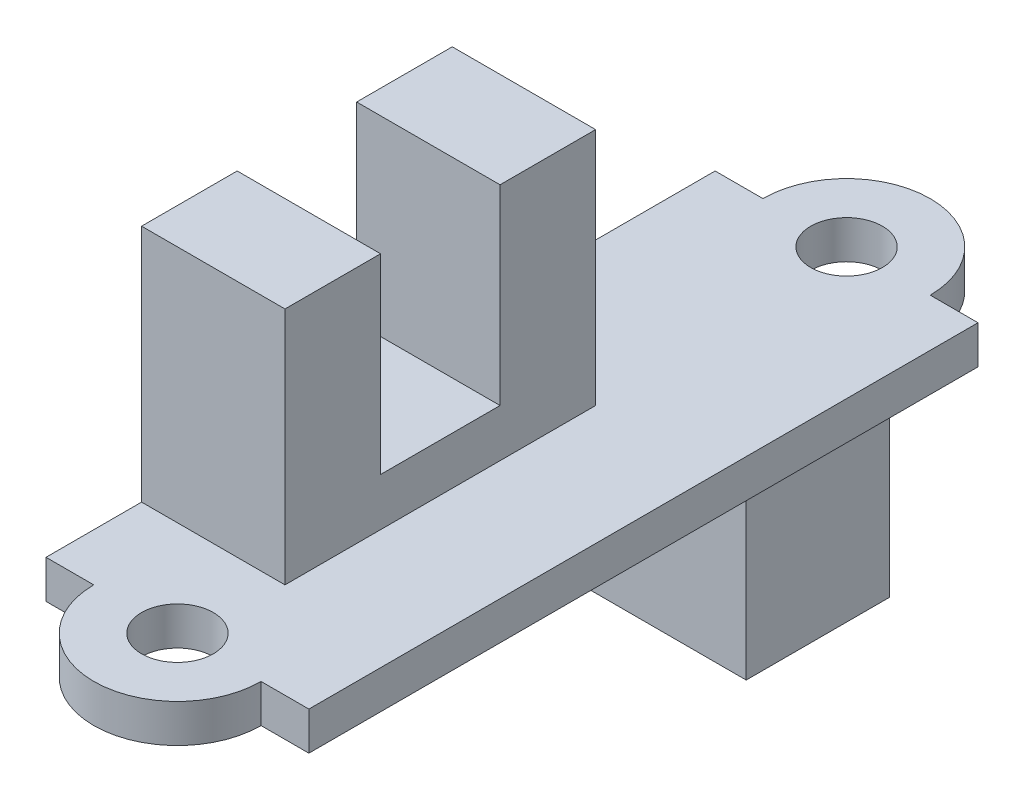
ISO-10303-21;
HEADER;
FILE_DESCRIPTION(('STEP AP214'),'2;1');
FILE_NAME('part.step','',(''),(''),'','','');
FILE_SCHEMA(('AUTOMOTIVE_DESIGN { 1 0 10303 214 1 1 1 1 }'));
ENDSEC;
DATA;
#1=APPLICATION_CONTEXT('core data for automotive mechanical design processes');
#2=APPLICATION_PROTOCOL_DEFINITION('international standard','automotive_design',2000,#1);
#3=PRODUCT_CONTEXT('',#1,'mechanical');
#4=PRODUCT('Part','Part','',(#3));
#5=PRODUCT_RELATED_PRODUCT_CATEGORY('part','',(#4));
#6=PRODUCT_DEFINITION_FORMATION('','',#4);
#7=PRODUCT_DEFINITION_CONTEXT('part definition',#1,'design');
#8=PRODUCT_DEFINITION('design','',#6,#7);
#9=PRODUCT_DEFINITION_SHAPE('','',#8);
#10=(LENGTH_UNIT() NAMED_UNIT(*) SI_UNIT(.MILLI.,.METRE.));
#11=(NAMED_UNIT(*) PLANE_ANGLE_UNIT() SI_UNIT($,.RADIAN.));
#12=(NAMED_UNIT(*) SI_UNIT($,.STERADIAN.) SOLID_ANGLE_UNIT());
#13=UNCERTAINTY_MEASURE_WITH_UNIT(LENGTH_MEASURE(1.E-05),#10,'distance_accuracy_value','');
#14=(GEOMETRIC_REPRESENTATION_CONTEXT(3) GLOBAL_UNCERTAINTY_ASSIGNED_CONTEXT((#13)) GLOBAL_UNIT_ASSIGNED_CONTEXT((#10,
#11,#12)) REPRESENTATION_CONTEXT('',''));
#15=CARTESIAN_POINT('',(0.,0.,0.));
#16=DIRECTION('',(0.,0.,1.));
#17=DIRECTION('',(1.,0.,0.));
#18=AXIS2_PLACEMENT_3D('',#15,#16,#17);
#19=CARTESIAN_POINT('',(0.,0.,0.));
#20=DIRECTION('',(0.,1.,0.));
#21=DIRECTION('',(0.,0.,1.));
#22=AXIS2_PLACEMENT_3D('',#19,#20,#21);
#23=PLANE('',#22);
#24=CARTESIAN_POINT('',(0.,0.,-28.));
#25=DIRECTION('',(0.,1.,0.));
#26=DIRECTION('',(0.,0.,1.));
#27=AXIS2_PLACEMENT_3D('',#24,#25,#26);
#28=CIRCLE('',#27,1.5);
#29=CARTESIAN_POINT('',(0.,0.,-26.5));
#30=VERTEX_POINT('',#29);
#31=EDGE_CURVE('E251',#30,#30,#28,.T.);
#32=ORIENTED_EDGE('',*,*,#31,.T.);
#33=EDGE_LOOP('',(#32));
#34=FACE_BOUND('',#33,.T.);
#35=CARTESIAN_POINT('',(0.,0.,0.));
#36=DIRECTION('',(0.,1.,0.));
#37=DIRECTION('',(0.,0.,1.));
#38=AXIS2_PLACEMENT_3D('',#35,#36,#37);
#39=CIRCLE('',#38,1.5);
#40=CARTESIAN_POINT('',(0.,0.,1.5));
#41=VERTEX_POINT('',#40);
#42=EDGE_CURVE('E255',#41,#41,#39,.T.);
#43=ORIENTED_EDGE('',*,*,#42,.T.);
#44=EDGE_LOOP('',(#43));
#45=FACE_BOUND('',#44,.T.);
#46=CARTESIAN_POINT('',(0.,0.,0.));
#47=DIRECTION('',(0.,1.,0.));
#48=DIRECTION('',(0.,0.,1.));
#49=AXIS2_PLACEMENT_3D('',#46,#47,#48);
#50=CIRCLE('',#49,3.5);
#51=CARTESIAN_POINT('',(-3.5,0.,0.));
#52=VERTEX_POINT('',#51);
#53=CARTESIAN_POINT('',(3.5,0.,0.));
#54=VERTEX_POINT('',#53);
#55=EDGE_CURVE('E261',#52,#54,#50,.T.);
#56=ORIENTED_EDGE('',*,*,#55,.F.);
#57=DIRECTION('',(1.,0.,0.));
#58=VECTOR('',#57,1.);
#59=CARTESIAN_POINT('',(-5.5,0.,0.));
#60=LINE('',#59,#58);
#61=CARTESIAN_POINT('',(-5.5,0.,0.));
#62=VERTEX_POINT('',#61);
#63=EDGE_CURVE('E268',#62,#52,#60,.T.);
#64=ORIENTED_EDGE('',*,*,#63,.F.);
#65=DIRECTION('',(0.,0.,1.));
#66=VECTOR('',#65,1.);
#67=CARTESIAN_POINT('',(-5.5,0.,-28.));
#68=LINE('',#67,#66);
#69=CARTESIAN_POINT('',(-5.5,0.,-28.));
#70=VERTEX_POINT('',#69);
#71=EDGE_CURVE('E297',#70,#62,#68,.T.);
#72=ORIENTED_EDGE('',*,*,#71,.F.);
#73=DIRECTION('',(-1.,0.,0.));
#74=VECTOR('',#73,1.);
#75=CARTESIAN_POINT('',(-5.5,0.,-28.));
#76=LINE('',#75,#74);
#77=CARTESIAN_POINT('',(-3.5,0.,-28.));
#78=VERTEX_POINT('',#77);
#79=EDGE_CURVE('E295',#78,#70,#76,.T.);
#80=ORIENTED_EDGE('',*,*,#79,.F.);
#81=CARTESIAN_POINT('',(0.,0.,-28.));
#82=DIRECTION('',(0.,1.,0.));
#83=DIRECTION('',(0.,0.,1.));
#84=AXIS2_PLACEMENT_3D('',#81,#82,#83);
#85=CIRCLE('',#84,3.5);
#86=CARTESIAN_POINT('',(3.5,0.,-28.));
#87=VERTEX_POINT('',#86);
#88=EDGE_CURVE('E293',#87,#78,#85,.T.);
#89=ORIENTED_EDGE('',*,*,#88,.F.);
#90=DIRECTION('',(-1.,0.,0.));
#91=VECTOR('',#90,1.);
#92=CARTESIAN_POINT('',(3.5,0.,-28.));
#93=LINE('',#92,#91);
#94=CARTESIAN_POINT('',(5.5,0.,-28.));
#95=VERTEX_POINT('',#94);
#96=EDGE_CURVE('E291',#95,#87,#93,.T.);
#97=ORIENTED_EDGE('',*,*,#96,.F.);
#98=DIRECTION('',(0.,0.,-1.));
#99=VECTOR('',#98,1.);
#100=CARTESIAN_POINT('',(5.5,0.,-28.));
#101=LINE('',#100,#99);
#102=CARTESIAN_POINT('',(5.5,0.,0.));
#103=VERTEX_POINT('',#102);
#104=EDGE_CURVE('E289',#103,#95,#101,.T.);
#105=ORIENTED_EDGE('',*,*,#104,.F.);
#106=DIRECTION('',(1.,0.,0.));
#107=VECTOR('',#106,1.);
#108=CARTESIAN_POINT('',(3.5,0.,0.));
#109=LINE('',#108,#107);
#110=EDGE_CURVE('E287',#54,#103,#109,.T.);
#111=ORIENTED_EDGE('',*,*,#110,.F.);
#112=EDGE_LOOP('',(#56,#64,#72,#80,#89,#97,#105,#111));
#113=FACE_BOUND('',#112,.T.);
#114=DIRECTION('',(0.,0.,-1.));
#115=VECTOR('',#114,1.);
#116=CARTESIAN_POINT('',(-5.,0.,-18.8));
#117=LINE('',#116,#115);
#118=CARTESIAN_POINT('',(-5.,0.,-18.8));
#119=VERTEX_POINT('',#118);
#120=CARTESIAN_POINT('',(-5.,0.,-24.8));
#121=VERTEX_POINT('',#120);
#122=EDGE_CURVE('E190',#119,#121,#117,.T.);
#123=ORIENTED_EDGE('',*,*,#122,.F.);
#124=DIRECTION('',(-1.,0.,0.));
#125=VECTOR('',#124,1.);
#126=CARTESIAN_POINT('',(-5.,0.,-18.8));
#127=LINE('',#126,#125);
#128=CARTESIAN_POINT('',(5.,0.,-18.8));
#129=VERTEX_POINT('',#128);
#130=EDGE_CURVE('E187',#129,#119,#127,.T.);
#131=ORIENTED_EDGE('',*,*,#130,.F.);
#132=DIRECTION('',(0.,0.,1.));
#133=VECTOR('',#132,1.);
#134=CARTESIAN_POINT('',(5.,0.,-18.8));
#135=LINE('',#134,#133);
#136=CARTESIAN_POINT('',(5.,0.,-24.8));
#137=VERTEX_POINT('',#136);
#138=EDGE_CURVE('E53',#137,#129,#135,.T.);
#139=ORIENTED_EDGE('',*,*,#138,.F.);
#140=DIRECTION('',(1.,0.,0.));
#141=VECTOR('',#140,1.);
#142=CARTESIAN_POINT('',(-5.,0.,-24.8));
#143=LINE('',#142,#141);
#144=EDGE_CURVE('E48',#121,#137,#143,.T.);
#145=ORIENTED_EDGE('',*,*,#144,.F.);
#146=EDGE_LOOP('',(#123,#131,#139,#145));
#147=FACE_BOUND('',#146,.T.);
#148=ADVANCED_FACE('F33',(#34,#45,#113,#147),#23,.F.);
#149=CARTESIAN_POINT('',(0.,1.6,0.));
#150=DIRECTION('',(0.,1.,0.));
#151=DIRECTION('',(0.,0.,1.));
#152=AXIS2_PLACEMENT_3D('',#149,#150,#151);
#153=PLANE('',#152);
#154=DIRECTION('',(-1.,0.,0.));
#155=VECTOR('',#154,1.);
#156=CARTESIAN_POINT('',(0.500000000000001,1.6,-17.));
#157=LINE('',#156,#155);
#158=CARTESIAN_POINT('',(0.500000000000001,1.6,-17.));
#159=VERTEX_POINT('',#158);
#160=CARTESIAN_POINT('',(-5.5,1.6,-17.));
#161=VERTEX_POINT('',#160);
#162=EDGE_CURVE('E248',#159,#161,#157,.T.);
#163=ORIENTED_EDGE('',*,*,#162,.F.);
#164=DIRECTION('',(0.,0.,-1.));
#165=VECTOR('',#164,1.);
#166=CARTESIAN_POINT('',(0.500000000000001,1.6,-17.));
#167=LINE('',#166,#165);
#168=CARTESIAN_POINT('',(0.500000000000003,1.6,-4.));
#169=VERTEX_POINT('',#168);
#170=EDGE_CURVE('E199',#169,#159,#167,.T.);
#171=ORIENTED_EDGE('',*,*,#170,.F.);
#172=DIRECTION('',(-1.,0.,0.));
#173=VECTOR('',#172,1.);
#174=CARTESIAN_POINT('',(0.500000000000003,1.6,-4.));
#175=LINE('',#174,#173);
#176=CARTESIAN_POINT('',(-5.5,1.6,-4.));
#177=VERTEX_POINT('',#176);
#178=EDGE_CURVE('E216',#169,#177,#175,.T.);
#179=ORIENTED_EDGE('',*,*,#178,.T.);
#180=DIRECTION('',(0.,0.,1.));
#181=VECTOR('',#180,1.);
#182=CARTESIAN_POINT('',(-5.5,1.6,-28.));
#183=LINE('',#182,#181);
#184=CARTESIAN_POINT('',(-5.5,1.6,0.));
#185=VERTEX_POINT('',#184);
#186=EDGE_CURVE('E278',#177,#185,#183,.T.);
#187=ORIENTED_EDGE('',*,*,#186,.T.);
#188=DIRECTION('',(1.,0.,0.));
#189=VECTOR('',#188,1.);
#190=CARTESIAN_POINT('',(-5.5,1.6,0.));
#191=LINE('',#190,#189);
#192=CARTESIAN_POINT('',(-3.5,1.6,0.));
#193=VERTEX_POINT('',#192);
#194=EDGE_CURVE('E282',#185,#193,#191,.T.);
#195=ORIENTED_EDGE('',*,*,#194,.T.);
#196=CARTESIAN_POINT('',(0.,1.6,0.));
#197=DIRECTION('',(0.,1.,0.));
#198=DIRECTION('',(0.,0.,1.));
#199=AXIS2_PLACEMENT_3D('',#196,#197,#198);
#200=CIRCLE('',#199,3.5);
#201=CARTESIAN_POINT('',(3.5,1.6,0.));
#202=VERTEX_POINT('',#201);
#203=EDGE_CURVE('E264',#193,#202,#200,.T.);
#204=ORIENTED_EDGE('',*,*,#203,.T.);
#205=DIRECTION('',(1.,0.,0.));
#206=VECTOR('',#205,1.);
#207=CARTESIAN_POINT('',(3.5,1.6,0.));
#208=LINE('',#207,#206);
#209=CARTESIAN_POINT('',(5.5,1.6,0.));
#210=VERTEX_POINT('',#209);
#211=EDGE_CURVE('E267',#202,#210,#208,.T.);
#212=ORIENTED_EDGE('',*,*,#211,.T.);
#213=DIRECTION('',(0.,0.,-1.));
#214=VECTOR('',#213,1.);
#215=CARTESIAN_POINT('',(5.5,1.6,-28.));
#216=LINE('',#215,#214);
#217=CARTESIAN_POINT('',(5.5,1.6,-28.));
#218=VERTEX_POINT('',#217);
#219=EDGE_CURVE('E270',#210,#218,#216,.T.);
#220=ORIENTED_EDGE('',*,*,#219,.T.);
#221=DIRECTION('',(-1.,0.,0.));
#222=VECTOR('',#221,1.);
#223=CARTESIAN_POINT('',(3.5,1.6,-28.));
#224=LINE('',#223,#222);
#225=CARTESIAN_POINT('',(3.5,1.6,-28.));
#226=VERTEX_POINT('',#225);
#227=EDGE_CURVE('E272',#218,#226,#224,.T.);
#228=ORIENTED_EDGE('',*,*,#227,.T.);
#229=CARTESIAN_POINT('',(0.,1.6,-28.));
#230=DIRECTION('',(0.,1.,0.));
#231=DIRECTION('',(0.,0.,1.));
#232=AXIS2_PLACEMENT_3D('',#229,#230,#231);
#233=CIRCLE('',#232,3.5);
#234=CARTESIAN_POINT('',(-3.5,1.6,-28.));
#235=VERTEX_POINT('',#234);
#236=EDGE_CURVE('E274',#226,#235,#233,.T.);
#237=ORIENTED_EDGE('',*,*,#236,.T.);
#238=DIRECTION('',(-1.,0.,0.));
#239=VECTOR('',#238,1.);
#240=CARTESIAN_POINT('',(-5.5,1.6,-28.));
#241=LINE('',#240,#239);
#242=CARTESIAN_POINT('',(-5.5,1.6,-28.));
#243=VERTEX_POINT('',#242);
#244=EDGE_CURVE('E276',#235,#243,#241,.T.);
#245=ORIENTED_EDGE('',*,*,#244,.T.);
#246=EDGE_CURVE('E279',#243,#161,#183,.T.);
#247=ORIENTED_EDGE('',*,*,#246,.T.);
#248=EDGE_LOOP('',(#163,#171,#179,#187,#195,#204,#212,#220,#228,#237,#245,#247));
#249=FACE_BOUND('',#248,.T.);
#250=CARTESIAN_POINT('',(0.,1.6,0.));
#251=DIRECTION('',(0.,1.,0.));
#252=DIRECTION('',(0.,0.,1.));
#253=AXIS2_PLACEMENT_3D('',#250,#251,#252);
#254=CIRCLE('',#253,1.5);
#255=CARTESIAN_POINT('',(0.,1.6,1.5));
#256=VERTEX_POINT('',#255);
#257=EDGE_CURVE('E258',#256,#256,#254,.T.);
#258=ORIENTED_EDGE('',*,*,#257,.F.);
#259=EDGE_LOOP('',(#258));
#260=FACE_BOUND('',#259,.T.);
#261=CARTESIAN_POINT('',(0.,1.6,-28.));
#262=DIRECTION('',(0.,1.,0.));
#263=DIRECTION('',(0.,0.,1.));
#264=AXIS2_PLACEMENT_3D('',#261,#262,#263);
#265=CIRCLE('',#264,1.5);
#266=CARTESIAN_POINT('',(0.,1.6,-26.5));
#267=VERTEX_POINT('',#266);
#268=EDGE_CURVE('E252',#267,#267,#265,.T.);
#269=ORIENTED_EDGE('',*,*,#268,.F.);
#270=EDGE_LOOP('',(#269));
#271=FACE_BOUND('',#270,.T.);
#272=ADVANCED_FACE('F340',(#249,#260,#271),#153,.T.);
#273=CARTESIAN_POINT('',(0.,1.6,0.));
#274=DIRECTION('',(0.,-1.,0.));
#275=DIRECTION('',(0.,0.,-1.));
#276=AXIS2_PLACEMENT_3D('',#273,#274,#275);
#277=CYLINDRICAL_SURFACE('',#276,3.5);
#278=ORIENTED_EDGE('',*,*,#55,.T.);
#279=DIRECTION('',(0.,-1.,0.));
#280=VECTOR('',#279,1.);
#281=CARTESIAN_POINT('',(3.5,1.6,0.));
#282=LINE('',#281,#280);
#283=EDGE_CURVE('E11',#202,#54,#282,.T.);
#284=ORIENTED_EDGE('',*,*,#283,.F.);
#285=ORIENTED_EDGE('',*,*,#203,.F.);
#286=DIRECTION('',(0.,-1.,0.));
#287=VECTOR('',#286,1.);
#288=CARTESIAN_POINT('',(-3.5,1.6,0.));
#289=LINE('',#288,#287);
#290=EDGE_CURVE('E284',#193,#52,#289,.T.);
#291=ORIENTED_EDGE('',*,*,#290,.T.);
#292=EDGE_LOOP('',(#278,#284,#285,#291));
#293=FACE_BOUND('',#292,.T.);
#294=ADVANCED_FACE('F35',(#293),#277,.T.);
#295=CARTESIAN_POINT('',(3.5,1.6,0.));
#296=DIRECTION('',(0.,0.,-1.));
#297=DIRECTION('',(-1.,0.,0.));
#298=AXIS2_PLACEMENT_3D('',#295,#296,#297);
#299=PLANE('',#298);
#300=ORIENTED_EDGE('',*,*,#110,.T.);
#301=DIRECTION('',(0.,-1.,0.));
#302=VECTOR('',#301,1.);
#303=CARTESIAN_POINT('',(5.5,1.6,0.));
#304=LINE('',#303,#302);
#305=EDGE_CURVE('E41',#210,#103,#304,.T.);
#306=ORIENTED_EDGE('',*,*,#305,.F.);
#307=ORIENTED_EDGE('',*,*,#211,.F.);
#308=ORIENTED_EDGE('',*,*,#283,.T.);
#309=EDGE_LOOP('',(#300,#306,#307,#308));
#310=FACE_BOUND('',#309,.T.);
#311=ADVANCED_FACE('F345',(#310),#299,.F.);
#312=CARTESIAN_POINT('',(5.5,1.6,-28.));
#313=DIRECTION('',(-1.,0.,0.));
#314=DIRECTION('',(0.,0.,1.));
#315=AXIS2_PLACEMENT_3D('',#312,#313,#314);
#316=PLANE('',#315);
#317=ORIENTED_EDGE('',*,*,#104,.T.);
#318=DIRECTION('',(0.,-1.,0.));
#319=VECTOR('',#318,1.);
#320=CARTESIAN_POINT('',(5.5,1.6,-28.));
#321=LINE('',#320,#319);
#322=EDGE_CURVE('E314',#218,#95,#321,.T.);
#323=ORIENTED_EDGE('',*,*,#322,.F.);
#324=ORIENTED_EDGE('',*,*,#219,.F.);
#325=ORIENTED_EDGE('',*,*,#305,.T.);
#326=EDGE_LOOP('',(#317,#323,#324,#325));
#327=FACE_BOUND('',#326,.T.);
#328=ADVANCED_FACE('F321',(#327),#316,.F.);
#329=CARTESIAN_POINT('',(3.5,1.6,-28.));
#330=DIRECTION('',(0.,0.,1.));
#331=DIRECTION('',(1.,0.,0.));
#332=AXIS2_PLACEMENT_3D('',#329,#330,#331);
#333=PLANE('',#332);
#334=ORIENTED_EDGE('',*,*,#96,.T.);
#335=DIRECTION('',(0.,-1.,0.));
#336=VECTOR('',#335,1.);
#337=CARTESIAN_POINT('',(3.5,1.6,-28.));
#338=LINE('',#337,#336);
#339=EDGE_CURVE('E311',#226,#87,#338,.T.);
#340=ORIENTED_EDGE('',*,*,#339,.F.);
#341=ORIENTED_EDGE('',*,*,#227,.F.);
#342=ORIENTED_EDGE('',*,*,#322,.T.);
#343=EDGE_LOOP('',(#334,#340,#341,#342));
#344=FACE_BOUND('',#343,.T.);
#345=ADVANCED_FACE('F331',(#344),#333,.F.);
#346=CARTESIAN_POINT('',(0.,1.6,-28.));
#347=DIRECTION('',(0.,-1.,0.));
#348=DIRECTION('',(0.,0.,-1.));
#349=AXIS2_PLACEMENT_3D('',#346,#347,#348);
#350=CYLINDRICAL_SURFACE('',#349,3.5);
#351=ORIENTED_EDGE('',*,*,#88,.T.);
#352=DIRECTION('',(0.,-1.,0.));
#353=VECTOR('',#352,1.);
#354=CARTESIAN_POINT('',(-3.5,1.6,-28.));
#355=LINE('',#354,#353);
#356=EDGE_CURVE('E308',#235,#78,#355,.T.);
#357=ORIENTED_EDGE('',*,*,#356,.F.);
#358=ORIENTED_EDGE('',*,*,#236,.F.);
#359=ORIENTED_EDGE('',*,*,#339,.T.);
#360=EDGE_LOOP('',(#351,#357,#358,#359));
#361=FACE_BOUND('',#360,.T.);
#362=ADVANCED_FACE('F335',(#361),#350,.T.);
#363=CARTESIAN_POINT('',(-5.5,1.6,-28.));
#364=DIRECTION('',(0.,0.,1.));
#365=DIRECTION('',(1.,0.,0.));
#366=AXIS2_PLACEMENT_3D('',#363,#364,#365);
#367=PLANE('',#366);
#368=ORIENTED_EDGE('',*,*,#79,.T.);
#369=DIRECTION('',(0.,-1.,0.));
#370=VECTOR('',#369,1.);
#371=CARTESIAN_POINT('',(-5.5,1.6,-28.));
#372=LINE('',#371,#370);
#373=EDGE_CURVE('E305',#243,#70,#372,.T.);
#374=ORIENTED_EDGE('',*,*,#373,.F.);
#375=ORIENTED_EDGE('',*,*,#244,.F.);
#376=ORIENTED_EDGE('',*,*,#356,.T.);
#377=EDGE_LOOP('',(#368,#374,#375,#376));
#378=FACE_BOUND('',#377,.T.);
#379=ADVANCED_FACE('F360',(#378),#367,.F.);
#380=CARTESIAN_POINT('',(-5.5,1.6,-28.));
#381=DIRECTION('',(1.,0.,0.));
#382=DIRECTION('',(0.,0.,-1.));
#383=AXIS2_PLACEMENT_3D('',#380,#381,#382);
#384=PLANE('',#383);
#385=ORIENTED_EDGE('',*,*,#71,.T.);
#386=DIRECTION('',(0.,-1.,0.));
#387=VECTOR('',#386,1.);
#388=CARTESIAN_POINT('',(-5.5,1.6,0.));
#389=LINE('',#388,#387);
#390=EDGE_CURVE('E302',#185,#62,#389,.T.);
#391=ORIENTED_EDGE('',*,*,#390,.F.);
#392=ORIENTED_EDGE('',*,*,#186,.F.);
#393=DIRECTION('',(0.,-1.,0.));
#394=VECTOR('',#393,1.);
#395=CARTESIAN_POINT('',(-5.5,1.6,-4.));
#396=LINE('',#395,#394);
#397=CARTESIAN_POINT('',(-5.5,11.6,-4.));
#398=VERTEX_POINT('',#397);
#399=EDGE_CURVE('E203',#398,#177,#396,.T.);
#400=ORIENTED_EDGE('',*,*,#399,.F.);
#401=DIRECTION('',(0.,0.,1.));
#402=VECTOR('',#401,1.);
#403=CARTESIAN_POINT('',(-5.5,11.6,-4.));
#404=LINE('',#403,#402);
#405=CARTESIAN_POINT('',(-5.5,11.6,-8.));
#406=VERTEX_POINT('',#405);
#407=EDGE_CURVE('E225',#406,#398,#404,.T.);
#408=ORIENTED_EDGE('',*,*,#407,.F.);
#409=DIRECTION('',(0.,1.,0.));
#410=VECTOR('',#409,1.);
#411=CARTESIAN_POINT('',(-5.5,11.6,-8.));
#412=LINE('',#411,#410);
#413=CARTESIAN_POINT('',(-5.5,3.6,-8.));
#414=VERTEX_POINT('',#413);
#415=EDGE_CURVE('E223',#414,#406,#412,.T.);
#416=ORIENTED_EDGE('',*,*,#415,.F.);
#417=DIRECTION('',(0.,0.,1.));
#418=VECTOR('',#417,1.);
#419=CARTESIAN_POINT('',(-5.5,3.6,-8.));
#420=LINE('',#419,#418);
#421=CARTESIAN_POINT('',(-5.5,3.6,-13.));
#422=VERTEX_POINT('',#421);
#423=EDGE_CURVE('E221',#422,#414,#420,.T.);
#424=ORIENTED_EDGE('',*,*,#423,.F.);
#425=DIRECTION('',(0.,-1.,0.));
#426=VECTOR('',#425,1.);
#427=CARTESIAN_POINT('',(-5.5,3.6,-13.));
#428=LINE('',#427,#426);
#429=CARTESIAN_POINT('',(-5.5,11.6,-13.));
#430=VERTEX_POINT('',#429);
#431=EDGE_CURVE('E219',#430,#422,#428,.T.);
#432=ORIENTED_EDGE('',*,*,#431,.F.);
#433=DIRECTION('',(0.,0.,1.));
#434=VECTOR('',#433,1.);
#435=CARTESIAN_POINT('',(-5.5,11.6,-13.));
#436=LINE('',#435,#434);
#437=CARTESIAN_POINT('',(-5.5,11.6,-17.));
#438=VERTEX_POINT('',#437);
#439=EDGE_CURVE('E193',#438,#430,#436,.T.);
#440=ORIENTED_EDGE('',*,*,#439,.F.);
#441=DIRECTION('',(0.,1.,0.));
#442=VECTOR('',#441,1.);
#443=CARTESIAN_POINT('',(-5.5,11.6,-17.));
#444=LINE('',#443,#442);
#445=EDGE_CURVE('E191',#161,#438,#444,.T.);
#446=ORIENTED_EDGE('',*,*,#445,.F.);
#447=ORIENTED_EDGE('',*,*,#246,.F.);
#448=ORIENTED_EDGE('',*,*,#373,.T.);
#449=EDGE_LOOP('',(#385,#391,#392,#400,#408,#416,#424,#432,#440,#446,#447,#448));
#450=FACE_BOUND('',#449,.T.);
#451=ADVANCED_FACE('F356',(#450),#384,.F.);
#452=CARTESIAN_POINT('',(-5.5,1.6,0.));
#453=DIRECTION('',(0.,0.,-1.));
#454=DIRECTION('',(-1.,0.,0.));
#455=AXIS2_PLACEMENT_3D('',#452,#453,#454);
#456=PLANE('',#455);
#457=ORIENTED_EDGE('',*,*,#63,.T.);
#458=ORIENTED_EDGE('',*,*,#290,.F.);
#459=ORIENTED_EDGE('',*,*,#194,.F.);
#460=ORIENTED_EDGE('',*,*,#390,.T.);
#461=EDGE_LOOP('',(#457,#458,#459,#460));
#462=FACE_BOUND('',#461,.T.);
#463=ADVANCED_FACE('F351',(#462),#456,.F.);
#464=CARTESIAN_POINT('',(0.,1.6,0.));
#465=DIRECTION('',(0.,-1.,0.));
#466=DIRECTION('',(0.,0.,-1.));
#467=AXIS2_PLACEMENT_3D('',#464,#465,#466);
#468=CYLINDRICAL_SURFACE('',#467,1.5);
#469=ORIENTED_EDGE('',*,*,#257,.T.);
#470=EDGE_LOOP('',(#469));
#471=FACE_BOUND('',#470,.T.);
#472=ORIENTED_EDGE('',*,*,#42,.F.);
#473=EDGE_LOOP('',(#472));
#474=FACE_BOUND('',#473,.T.);
#475=ADVANCED_FACE('F380',(#471,#474),#468,.F.);
#476=CARTESIAN_POINT('',(0.,1.6,-28.));
#477=DIRECTION('',(0.,-1.,0.));
#478=DIRECTION('',(0.,0.,-1.));
#479=AXIS2_PLACEMENT_3D('',#476,#477,#478);
#480=CYLINDRICAL_SURFACE('',#479,1.5);
#481=ORIENTED_EDGE('',*,*,#268,.T.);
#482=EDGE_LOOP('',(#481));
#483=FACE_BOUND('',#482,.T.);
#484=ORIENTED_EDGE('',*,*,#31,.F.);
#485=EDGE_LOOP('',(#484));
#486=FACE_BOUND('',#485,.T.);
#487=ADVANCED_FACE('F384',(#483,#486),#480,.F.);
#488=CARTESIAN_POINT('',(0.500000000000001,11.6,-17.));
#489=DIRECTION('',(0.,0.,1.));
#490=DIRECTION('',(1.,0.,0.));
#491=AXIS2_PLACEMENT_3D('',#488,#489,#490);
#492=PLANE('',#491);
#493=ORIENTED_EDGE('',*,*,#445,.T.);
#494=DIRECTION('',(-1.,0.,0.));
#495=VECTOR('',#494,1.);
#496=CARTESIAN_POINT('',(0.500000000000001,11.6,-17.));
#497=LINE('',#496,#495);
#498=CARTESIAN_POINT('',(0.500000000000001,11.6,-17.));
#499=VERTEX_POINT('',#498);
#500=EDGE_CURVE('E245',#499,#438,#497,.T.);
#501=ORIENTED_EDGE('',*,*,#500,.F.);
#502=DIRECTION('',(0.,1.,0.));
#503=VECTOR('',#502,1.);
#504=CARTESIAN_POINT('',(0.500000000000001,11.6,-17.));
#505=LINE('',#504,#503);
#506=EDGE_CURVE('E202',#159,#499,#505,.T.);
#507=ORIENTED_EDGE('',*,*,#506,.F.);
#508=ORIENTED_EDGE('',*,*,#162,.T.);
#509=EDGE_LOOP('',(#493,#501,#507,#508));
#510=FACE_BOUND('',#509,.T.);
#511=ADVANCED_FACE('F389',(#510),#492,.F.);
#512=CARTESIAN_POINT('',(0.500000000000002,11.6,-13.));
#513=DIRECTION('',(0.,-1.,0.));
#514=DIRECTION('',(0.,0.,-1.));
#515=AXIS2_PLACEMENT_3D('',#512,#513,#514);
#516=PLANE('',#515);
#517=ORIENTED_EDGE('',*,*,#439,.T.);
#518=DIRECTION('',(-1.,0.,0.));
#519=VECTOR('',#518,1.);
#520=CARTESIAN_POINT('',(0.500000000000002,11.6,-13.));
#521=LINE('',#520,#519);
#522=CARTESIAN_POINT('',(0.500000000000002,11.6,-13.));
#523=VERTEX_POINT('',#522);
#524=EDGE_CURVE('E242',#523,#430,#521,.T.);
#525=ORIENTED_EDGE('',*,*,#524,.F.);
#526=DIRECTION('',(0.,0.,1.));
#527=VECTOR('',#526,1.);
#528=CARTESIAN_POINT('',(0.500000000000002,11.6,-13.));
#529=LINE('',#528,#527);
#530=EDGE_CURVE('E205',#499,#523,#529,.T.);
#531=ORIENTED_EDGE('',*,*,#530,.F.);
#532=ORIENTED_EDGE('',*,*,#500,.T.);
#533=EDGE_LOOP('',(#517,#525,#531,#532));
#534=FACE_BOUND('',#533,.T.);
#535=ADVANCED_FACE('F396',(#534),#516,.F.);
#536=CARTESIAN_POINT('',(0.500000000000002,3.6,-13.));
#537=DIRECTION('',(0.,0.,-1.));
#538=DIRECTION('',(-1.,0.,0.));
#539=AXIS2_PLACEMENT_3D('',#536,#537,#538);
#540=PLANE('',#539);
#541=ORIENTED_EDGE('',*,*,#431,.T.);
#542=DIRECTION('',(-1.,0.,0.));
#543=VECTOR('',#542,1.);
#544=CARTESIAN_POINT('',(0.500000000000002,3.6,-13.));
#545=LINE('',#544,#543);
#546=CARTESIAN_POINT('',(0.500000000000002,3.6,-13.));
#547=VERTEX_POINT('',#546);
#548=EDGE_CURVE('E239',#547,#422,#545,.T.);
#549=ORIENTED_EDGE('',*,*,#548,.F.);
#550=DIRECTION('',(0.,-1.,0.));
#551=VECTOR('',#550,1.);
#552=CARTESIAN_POINT('',(0.500000000000002,3.6,-13.));
#553=LINE('',#552,#551);
#554=EDGE_CURVE('E207',#523,#547,#553,.T.);
#555=ORIENTED_EDGE('',*,*,#554,.F.);
#556=ORIENTED_EDGE('',*,*,#524,.T.);
#557=EDGE_LOOP('',(#541,#549,#555,#556));
#558=FACE_BOUND('',#557,.T.);
#559=ADVANCED_FACE('F400',(#558),#540,.F.);
#560=CARTESIAN_POINT('',(0.500000000000003,3.6,-8.));
#561=DIRECTION('',(0.,-1.,0.));
#562=DIRECTION('',(0.,0.,-1.));
#563=AXIS2_PLACEMENT_3D('',#560,#561,#562);
#564=PLANE('',#563);
#565=ORIENTED_EDGE('',*,*,#423,.T.);
#566=DIRECTION('',(-1.,0.,0.));
#567=VECTOR('',#566,1.);
#568=CARTESIAN_POINT('',(0.500000000000003,3.6,-8.));
#569=LINE('',#568,#567);
#570=CARTESIAN_POINT('',(0.500000000000003,3.6,-8.));
#571=VERTEX_POINT('',#570);
#572=EDGE_CURVE('E236',#571,#414,#569,.T.);
#573=ORIENTED_EDGE('',*,*,#572,.F.);
#574=DIRECTION('',(0.,0.,1.));
#575=VECTOR('',#574,1.);
#576=CARTESIAN_POINT('',(0.500000000000003,3.6,-8.));
#577=LINE('',#576,#575);
#578=EDGE_CURVE('E209',#547,#571,#577,.T.);
#579=ORIENTED_EDGE('',*,*,#578,.F.);
#580=ORIENTED_EDGE('',*,*,#548,.T.);
#581=EDGE_LOOP('',(#565,#573,#579,#580));
#582=FACE_BOUND('',#581,.T.);
#583=ADVANCED_FACE('F404',(#582),#564,.F.);
#584=CARTESIAN_POINT('',(0.500000000000003,11.6,-8.));
#585=DIRECTION('',(0.,0.,1.));
#586=DIRECTION('',(1.,0.,0.));
#587=AXIS2_PLACEMENT_3D('',#584,#585,#586);
#588=PLANE('',#587);
#589=ORIENTED_EDGE('',*,*,#415,.T.);
#590=DIRECTION('',(-1.,0.,0.));
#591=VECTOR('',#590,1.);
#592=CARTESIAN_POINT('',(0.500000000000003,11.6,-8.));
#593=LINE('',#592,#591);
#594=CARTESIAN_POINT('',(0.500000000000003,11.6,-8.));
#595=VERTEX_POINT('',#594);
#596=EDGE_CURVE('E233',#595,#406,#593,.T.);
#597=ORIENTED_EDGE('',*,*,#596,.F.);
#598=DIRECTION('',(0.,1.,0.));
#599=VECTOR('',#598,1.);
#600=CARTESIAN_POINT('',(0.500000000000003,11.6,-8.));
#601=LINE('',#600,#599);
#602=EDGE_CURVE('E211',#571,#595,#601,.T.);
#603=ORIENTED_EDGE('',*,*,#602,.F.);
#604=ORIENTED_EDGE('',*,*,#572,.T.);
#605=EDGE_LOOP('',(#589,#597,#603,#604));
#606=FACE_BOUND('',#605,.T.);
#607=ADVANCED_FACE('F408',(#606),#588,.F.);
#608=CARTESIAN_POINT('',(0.500000000000003,11.6,-4.));
#609=DIRECTION('',(0.,-1.,0.));
#610=DIRECTION('',(0.,0.,-1.));
#611=AXIS2_PLACEMENT_3D('',#608,#609,#610);
#612=PLANE('',#611);
#613=ORIENTED_EDGE('',*,*,#407,.T.);
#614=DIRECTION('',(-1.,0.,0.));
#615=VECTOR('',#614,1.);
#616=CARTESIAN_POINT('',(0.500000000000003,11.6,-4.));
#617=LINE('',#616,#615);
#618=CARTESIAN_POINT('',(0.500000000000003,11.6,-4.));
#619=VERTEX_POINT('',#618);
#620=EDGE_CURVE('E230',#619,#398,#617,.T.);
#621=ORIENTED_EDGE('',*,*,#620,.F.);
#622=DIRECTION('',(0.,0.,1.));
#623=VECTOR('',#622,1.);
#624=CARTESIAN_POINT('',(0.500000000000003,11.6,-4.));
#625=LINE('',#624,#623);
#626=EDGE_CURVE('E213',#595,#619,#625,.T.);
#627=ORIENTED_EDGE('',*,*,#626,.F.);
#628=ORIENTED_EDGE('',*,*,#596,.T.);
#629=EDGE_LOOP('',(#613,#621,#627,#628));
#630=FACE_BOUND('',#629,.T.);
#631=ADVANCED_FACE('F412',(#630),#612,.F.);
#632=CARTESIAN_POINT('',(0.500000000000003,1.6,-4.));
#633=DIRECTION('',(0.,0.,-1.));
#634=DIRECTION('',(-1.,0.,0.));
#635=AXIS2_PLACEMENT_3D('',#632,#633,#634);
#636=PLANE('',#635);
#637=ORIENTED_EDGE('',*,*,#399,.T.);
#638=ORIENTED_EDGE('',*,*,#178,.F.);
#639=DIRECTION('',(0.,-1.,0.));
#640=VECTOR('',#639,1.);
#641=CARTESIAN_POINT('',(0.500000000000003,1.6,-4.));
#642=LINE('',#641,#640);
#643=EDGE_CURVE('E215',#619,#169,#642,.T.);
#644=ORIENTED_EDGE('',*,*,#643,.F.);
#645=ORIENTED_EDGE('',*,*,#620,.T.);
#646=EDGE_LOOP('',(#637,#638,#644,#645));
#647=FACE_BOUND('',#646,.T.);
#648=ADVANCED_FACE('F416',(#647),#636,.F.);
#649=CARTESIAN_POINT('',(0.500000000000004,0.,0.));
#650=DIRECTION('',(-1.,0.,0.));
#651=DIRECTION('',(0.,0.,1.));
#652=AXIS2_PLACEMENT_3D('',#649,#650,#651);
#653=PLANE('',#652);
#654=ORIENTED_EDGE('',*,*,#170,.T.);
#655=ORIENTED_EDGE('',*,*,#506,.T.);
#656=ORIENTED_EDGE('',*,*,#530,.T.);
#657=ORIENTED_EDGE('',*,*,#554,.T.);
#658=ORIENTED_EDGE('',*,*,#578,.T.);
#659=ORIENTED_EDGE('',*,*,#602,.T.);
#660=ORIENTED_EDGE('',*,*,#626,.T.);
#661=ORIENTED_EDGE('',*,*,#643,.T.);
#662=EDGE_LOOP('',(#654,#655,#656,#657,#658,#659,#660,#661));
#663=FACE_BOUND('',#662,.T.);
#664=ADVANCED_FACE('F420',(#663),#653,.F.);
#665=CARTESIAN_POINT('',(-5.,-7.,-18.8));
#666=DIRECTION('',(1.,0.,0.));
#667=DIRECTION('',(0.,0.,-1.));
#668=AXIS2_PLACEMENT_3D('',#665,#666,#667);
#669=PLANE('',#668);
#670=ORIENTED_EDGE('',*,*,#122,.T.);
#671=DIRECTION('',(0.,1.,0.));
#672=VECTOR('',#671,1.);
#673=CARTESIAN_POINT('',(-5.,-7.,-24.8));
#674=LINE('',#673,#672);
#675=CARTESIAN_POINT('',(-5.,-7.,-24.8));
#676=VERTEX_POINT('',#675);
#677=EDGE_CURVE('E171',#676,#121,#674,.T.);
#678=ORIENTED_EDGE('',*,*,#677,.F.);
#679=DIRECTION('',(0.,0.,-1.));
#680=VECTOR('',#679,1.);
#681=CARTESIAN_POINT('',(-5.,-7.,-18.8));
#682=LINE('',#681,#680);
#683=CARTESIAN_POINT('',(-5.,-7.,-18.8));
#684=VERTEX_POINT('',#683);
#685=EDGE_CURVE('E178',#684,#676,#682,.T.);
#686=ORIENTED_EDGE('',*,*,#685,.F.);
#687=DIRECTION('',(0.,1.,0.));
#688=VECTOR('',#687,1.);
#689=CARTESIAN_POINT('',(-5.,-7.,-18.8));
#690=LINE('',#689,#688);
#691=EDGE_CURVE('E591',#684,#119,#690,.T.);
#692=ORIENTED_EDGE('',*,*,#691,.T.);
#693=EDGE_LOOP('',(#670,#678,#686,#692));
#694=FACE_BOUND('',#693,.T.);
#695=ADVANCED_FACE('F189',(#694),#669,.F.);
#696=CARTESIAN_POINT('',(-5.,-7.,-24.8));
#697=DIRECTION('',(0.,0.,1.));
#698=DIRECTION('',(1.,0.,0.));
#699=AXIS2_PLACEMENT_3D('',#696,#697,#698);
#700=PLANE('',#699);
#701=ORIENTED_EDGE('',*,*,#144,.T.);
#702=DIRECTION('',(0.,1.,0.));
#703=VECTOR('',#702,1.);
#704=CARTESIAN_POINT('',(5.,-7.,-24.8));
#705=LINE('',#704,#703);
#706=CARTESIAN_POINT('',(5.,-7.,-24.8));
#707=VERTEX_POINT('',#706);
#708=EDGE_CURVE('E174',#707,#137,#705,.T.);
#709=ORIENTED_EDGE('',*,*,#708,.F.);
#710=DIRECTION('',(1.,0.,0.));
#711=VECTOR('',#710,1.);
#712=CARTESIAN_POINT('',(-5.,-7.,-24.8));
#713=LINE('',#712,#711);
#714=EDGE_CURVE('E167',#676,#707,#713,.T.);
#715=ORIENTED_EDGE('',*,*,#714,.F.);
#716=ORIENTED_EDGE('',*,*,#677,.T.);
#717=EDGE_LOOP('',(#701,#709,#715,#716));
#718=FACE_BOUND('',#717,.T.);
#719=ADVANCED_FACE('F169',(#718),#700,.F.);
#720=CARTESIAN_POINT('',(5.,-7.,-18.8));
#721=DIRECTION('',(-1.,0.,0.));
#722=DIRECTION('',(0.,0.,1.));
#723=AXIS2_PLACEMENT_3D('',#720,#721,#722);
#724=PLANE('',#723);
#725=ORIENTED_EDGE('',*,*,#138,.T.);
#726=DIRECTION('',(0.,1.,0.));
#727=VECTOR('',#726,1.);
#728=CARTESIAN_POINT('',(5.,-7.,-18.8));
#729=LINE('',#728,#727);
#730=CARTESIAN_POINT('',(5.,-7.,-18.8));
#731=VERTEX_POINT('',#730);
#732=EDGE_CURVE('E195',#731,#129,#729,.T.);
#733=ORIENTED_EDGE('',*,*,#732,.F.);
#734=DIRECTION('',(0.,0.,1.));
#735=VECTOR('',#734,1.);
#736=CARTESIAN_POINT('',(5.,-7.,-18.8));
#737=LINE('',#736,#735);
#738=EDGE_CURVE('E177',#707,#731,#737,.T.);
#739=ORIENTED_EDGE('',*,*,#738,.F.);
#740=ORIENTED_EDGE('',*,*,#708,.T.);
#741=EDGE_LOOP('',(#725,#733,#739,#740));
#742=FACE_BOUND('',#741,.T.);
#743=ADVANCED_FACE('F429',(#742),#724,.F.);
#744=CARTESIAN_POINT('',(-5.,-7.,-18.8));
#745=DIRECTION('',(0.,0.,-1.));
#746=DIRECTION('',(-1.,0.,0.));
#747=AXIS2_PLACEMENT_3D('',#744,#745,#746);
#748=PLANE('',#747);
#749=ORIENTED_EDGE('',*,*,#130,.T.);
#750=ORIENTED_EDGE('',*,*,#691,.F.);
#751=DIRECTION('',(-1.,0.,0.));
#752=VECTOR('',#751,1.);
#753=CARTESIAN_POINT('',(-5.,-7.,-18.8));
#754=LINE('',#753,#752);
#755=EDGE_CURVE('E183',#731,#684,#754,.T.);
#756=ORIENTED_EDGE('',*,*,#755,.F.);
#757=ORIENTED_EDGE('',*,*,#732,.T.);
#758=EDGE_LOOP('',(#749,#750,#756,#757));
#759=FACE_BOUND('',#758,.T.);
#760=ADVANCED_FACE('F432',(#759),#748,.F.);
#761=CARTESIAN_POINT('',(0.,-7.,0.));
#762=DIRECTION('',(0.,-1.,0.));
#763=DIRECTION('',(0.,0.,-1.));
#764=AXIS2_PLACEMENT_3D('',#761,#762,#763);
#765=PLANE('',#764);
#766=ORIENTED_EDGE('',*,*,#685,.T.);
#767=ORIENTED_EDGE('',*,*,#714,.T.);
#768=ORIENTED_EDGE('',*,*,#738,.T.);
#769=ORIENTED_EDGE('',*,*,#755,.T.);
#770=EDGE_LOOP('',(#766,#767,#768,#769));
#771=FACE_BOUND('',#770,.T.);
#772=ADVANCED_FACE('F181',(#771),#765,.T.);
#773=CLOSED_SHELL('',(#148,#272,#294,#311,#328,#345,#362,#379,#451,#463,#475,#487,#511,#535,
#559,#583,#607,#631,#648,#664,#695,#719,#743,#760,#772));
#774=MANIFOLD_SOLID_BREP('B2',#773);
#775=ADVANCED_BREP_SHAPE_REPRESENTATION('',(#18,#774),#14);
#776=SHAPE_DEFINITION_REPRESENTATION(#9,#775);
ENDSEC;
END-ISO-10303-21;
